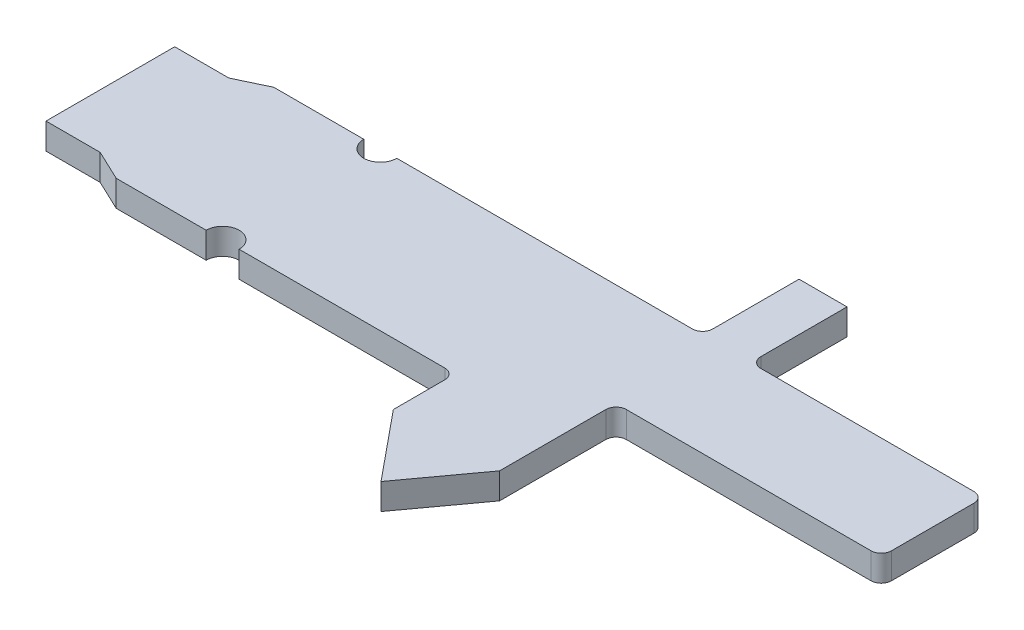
ISO-10303-21;
HEADER;
FILE_DESCRIPTION(('STEP AP214'),'2;1');
FILE_NAME('part.step','',(''),(''),'','','');
FILE_SCHEMA(('AUTOMOTIVE_DESIGN { 1 0 10303 214 1 1 1 1 }'));
ENDSEC;
DATA;
#1=APPLICATION_CONTEXT('core data for automotive mechanical design processes');
#2=APPLICATION_PROTOCOL_DEFINITION('international standard','automotive_design',2000,#1);
#3=PRODUCT_CONTEXT('',#1,'mechanical');
#4=PRODUCT('Part','Part','',(#3));
#5=PRODUCT_RELATED_PRODUCT_CATEGORY('part','',(#4));
#6=PRODUCT_DEFINITION_FORMATION('','',#4);
#7=PRODUCT_DEFINITION_CONTEXT('part definition',#1,'design');
#8=PRODUCT_DEFINITION('design','',#6,#7);
#9=PRODUCT_DEFINITION_SHAPE('','',#8);
#10=(LENGTH_UNIT() NAMED_UNIT(*) SI_UNIT(.MILLI.,.METRE.));
#11=(NAMED_UNIT(*) PLANE_ANGLE_UNIT() SI_UNIT($,.RADIAN.));
#12=(NAMED_UNIT(*) SI_UNIT($,.STERADIAN.) SOLID_ANGLE_UNIT());
#13=UNCERTAINTY_MEASURE_WITH_UNIT(LENGTH_MEASURE(1.E-05),#10,'distance_accuracy_value','');
#14=(GEOMETRIC_REPRESENTATION_CONTEXT(3) GLOBAL_UNCERTAINTY_ASSIGNED_CONTEXT((#13)) GLOBAL_UNIT_ASSIGNED_CONTEXT((#10,
#11,#12)) REPRESENTATION_CONTEXT('',''));
#15=CARTESIAN_POINT('',(0.,0.,0.));
#16=DIRECTION('',(0.,0.,1.));
#17=DIRECTION('',(1.,0.,0.));
#18=AXIS2_PLACEMENT_3D('',#15,#16,#17);
#19=CARTESIAN_POINT('',(-7.64733179537499,0.9652,2.921));
#20=DIRECTION('',(0.,-1.,0.));
#21=DIRECTION('',(0.,0.,-1.));
#22=AXIS2_PLACEMENT_3D('',#19,#20,#21);
#23=CYLINDRICAL_SURFACE('',#22,0.611531795374986);
#24=CARTESIAN_POINT('',(-7.64733179537499,0.,2.921));
#25=DIRECTION('',(0.,1.,0.));
#26=DIRECTION('',(0.,0.,1.));
#27=AXIS2_PLACEMENT_3D('',#24,#25,#26);
#28=CIRCLE('',#27,0.611531795374986);
#29=CARTESIAN_POINT('',(-7.0358,0.,2.921));
#30=VERTEX_POINT('',#29);
#31=CARTESIAN_POINT('',(-8.25886359074998,0.,2.921));
#32=VERTEX_POINT('',#31);
#33=EDGE_CURVE('E241',#30,#32,#28,.T.);
#34=ORIENTED_EDGE('',*,*,#33,.F.);
#35=DIRECTION('',(0.,-1.,0.));
#36=VECTOR('',#35,1.);
#37=CARTESIAN_POINT('',(-7.0358,0.9652,2.921));
#38=LINE('',#37,#36);
#39=CARTESIAN_POINT('',(-7.0358,0.9652,2.921));
#40=VERTEX_POINT('',#39);
#41=EDGE_CURVE('E11',#40,#30,#38,.T.);
#42=ORIENTED_EDGE('',*,*,#41,.F.);
#43=CARTESIAN_POINT('',(-7.64733179537499,0.9652,2.921));
#44=DIRECTION('',(0.,1.,0.));
#45=DIRECTION('',(0.,0.,1.));
#46=AXIS2_PLACEMENT_3D('',#43,#44,#45);
#47=CIRCLE('',#46,0.611531795374986);
#48=CARTESIAN_POINT('',(-8.25886359074998,0.9652,2.921));
#49=VERTEX_POINT('',#48);
#50=EDGE_CURVE('E312',#40,#49,#47,.T.);
#51=ORIENTED_EDGE('',*,*,#50,.T.);
#52=DIRECTION('',(0.,-1.,0.));
#53=VECTOR('',#52,1.);
#54=CARTESIAN_POINT('',(-8.25886359074998,0.9652,2.921));
#55=LINE('',#54,#53);
#56=EDGE_CURVE('E51',#49,#32,#55,.T.);
#57=ORIENTED_EDGE('',*,*,#56,.T.);
#58=EDGE_LOOP('',(#34,#42,#51,#57));
#59=FACE_BOUND('',#58,.T.);
#60=ADVANCED_FACE('F35',(#59),#23,.F.);
#61=CARTESIAN_POINT('',(0.,0.9652,2.921));
#62=DIRECTION('',(0.,0.,1.));
#63=DIRECTION('',(1.,0.,0.));
#64=AXIS2_PLACEMENT_3D('',#61,#62,#63);
#65=PLANE('',#64);
#66=DIRECTION('',(-1.,0.,0.));
#67=VECTOR('',#66,1.);
#68=CARTESIAN_POINT('',(0.,0.,2.921));
#69=LINE('',#68,#67);
#70=CARTESIAN_POINT('',(0.584199999999997,0.,2.921));
#71=VERTEX_POINT('',#70);
#72=EDGE_CURVE('E243',#71,#30,#69,.T.);
#73=ORIENTED_EDGE('',*,*,#72,.F.);
#74=DIRECTION('',(0.,-1.,0.));
#75=VECTOR('',#74,1.);
#76=CARTESIAN_POINT('',(0.584199999999997,0.9652,2.921));
#77=LINE('',#76,#75);
#78=CARTESIAN_POINT('',(0.584199999999997,0.9652,2.921));
#79=VERTEX_POINT('',#78);
#80=EDGE_CURVE('E43',#79,#71,#77,.T.);
#81=ORIENTED_EDGE('',*,*,#80,.F.);
#82=DIRECTION('',(-1.,0.,0.));
#83=VECTOR('',#82,1.);
#84=CARTESIAN_POINT('',(0.,0.9652,2.921));
#85=LINE('',#84,#83);
#86=EDGE_CURVE('E378',#79,#40,#85,.T.);
#87=ORIENTED_EDGE('',*,*,#86,.T.);
#88=ORIENTED_EDGE('',*,*,#41,.T.);
#89=EDGE_LOOP('',(#73,#81,#87,#88));
#90=FACE_BOUND('',#89,.T.);
#91=ADVANCED_FACE('F377',(#90),#65,.T.);
#92=CARTESIAN_POINT('',(0.5842,0.9652,3.302));
#93=DIRECTION('',(0.,-1.,0.));
#94=DIRECTION('',(0.,0.,-1.));
#95=AXIS2_PLACEMENT_3D('',#92,#93,#94);
#96=CYLINDRICAL_SURFACE('',#95,0.381);
#97=CARTESIAN_POINT('',(0.5842,0.,3.302));
#98=DIRECTION('',(0.,1.,0.));
#99=DIRECTION('',(0.,0.,1.));
#100=AXIS2_PLACEMENT_3D('',#97,#98,#99);
#101=CIRCLE('',#100,0.381);
#102=CARTESIAN_POINT('',(0.9652,0.,3.302));
#103=VERTEX_POINT('',#102);
#104=EDGE_CURVE('E246',#71,#103,#101,.F.);
#105=ORIENTED_EDGE('',*,*,#104,.T.);
#106=DIRECTION('',(0.,-1.,0.));
#107=VECTOR('',#106,1.);
#108=CARTESIAN_POINT('',(0.9652,0.9652,3.302));
#109=LINE('',#108,#107);
#110=CARTESIAN_POINT('',(0.9652,0.9652,3.302));
#111=VERTEX_POINT('',#110);
#112=EDGE_CURVE('E361',#111,#103,#109,.T.);
#113=ORIENTED_EDGE('',*,*,#112,.F.);
#114=CARTESIAN_POINT('',(0.5842,0.9652,3.302));
#115=DIRECTION('',(0.,1.,0.));
#116=DIRECTION('',(0.,0.,1.));
#117=AXIS2_PLACEMENT_3D('',#114,#115,#116);
#118=CIRCLE('',#117,0.381);
#119=EDGE_CURVE('E368',#79,#111,#118,.F.);
#120=ORIENTED_EDGE('',*,*,#119,.F.);
#121=ORIENTED_EDGE('',*,*,#80,.T.);
#122=EDGE_LOOP('',(#105,#113,#120,#121));
#123=FACE_BOUND('',#122,.T.);
#124=ADVANCED_FACE('F366',(#123),#96,.F.);
#125=CARTESIAN_POINT('',(0.9652,0.9652,0.));
#126=DIRECTION('',(1.,0.,0.));
#127=DIRECTION('',(0.,0.,-1.));
#128=AXIS2_PLACEMENT_3D('',#125,#126,#127);
#129=PLANE('',#128);
#130=DIRECTION('',(0.,0.,1.));
#131=VECTOR('',#130,1.);
#132=CARTESIAN_POINT('',(0.9652,0.,0.));
#133=LINE('',#132,#131);
#134=CARTESIAN_POINT('',(0.9652,0.,5.207));
#135=VERTEX_POINT('',#134);
#136=EDGE_CURVE('E248',#103,#135,#133,.T.);
#137=ORIENTED_EDGE('',*,*,#136,.T.);
#138=DIRECTION('',(0.,-1.,0.));
#139=VECTOR('',#138,1.);
#140=CARTESIAN_POINT('',(0.9652,0.9652,5.207));
#141=LINE('',#140,#139);
#142=CARTESIAN_POINT('',(0.9652,0.9652,5.207));
#143=VERTEX_POINT('',#142);
#144=EDGE_CURVE('E358',#143,#135,#141,.T.);
#145=ORIENTED_EDGE('',*,*,#144,.F.);
#146=DIRECTION('',(0.,0.,1.));
#147=VECTOR('',#146,1.);
#148=CARTESIAN_POINT('',(0.9652,0.9652,0.));
#149=LINE('',#148,#147);
#150=EDGE_CURVE('E727',#111,#143,#149,.T.);
#151=ORIENTED_EDGE('',*,*,#150,.F.);
#152=ORIENTED_EDGE('',*,*,#112,.T.);
#153=EDGE_LOOP('',(#137,#145,#151,#152));
#154=FACE_BOUND('',#153,.T.);
#155=ADVANCED_FACE('F396',(#154),#129,.F.);
#156=CARTESIAN_POINT('',(-1.97592681176752,0.9652,1.62025998564937));
#157=DIRECTION('',(0.773267790496398,0.,-0.634079588207047));
#158=DIRECTION('',(-0.634079588207047,0.,-0.773267790496398));
#159=AXIS2_PLACEMENT_3D('',#156,#157,#158);
#160=PLANE('',#159);
#161=DIRECTION('',(0.634079588207047,0.,0.773267790496398));
#162=VECTOR('',#161,1.);
#163=CARTESIAN_POINT('',(-1.97592681176752,0.,1.62025998564937));
#164=LINE('',#163,#162);
#165=CARTESIAN_POINT('',(3.048,0.,7.747));
#166=VERTEX_POINT('',#165);
#167=EDGE_CURVE('E250',#135,#166,#164,.T.);
#168=ORIENTED_EDGE('',*,*,#167,.T.);
#169=DIRECTION('',(0.,-1.,0.));
#170=VECTOR('',#169,1.);
#171=CARTESIAN_POINT('',(3.048,0.9652,7.747));
#172=LINE('',#171,#170);
#173=CARTESIAN_POINT('',(3.048,0.9652,7.747));
#174=VERTEX_POINT('',#173);
#175=EDGE_CURVE('E356',#174,#166,#172,.T.);
#176=ORIENTED_EDGE('',*,*,#175,.F.);
#177=DIRECTION('',(0.634079588207047,0.,0.773267790496398));
#178=VECTOR('',#177,1.);
#179=CARTESIAN_POINT('',(-1.97592681176752,0.9652,1.62025998564937));
#180=LINE('',#179,#178);
#181=EDGE_CURVE('E725',#143,#174,#180,.T.);
#182=ORIENTED_EDGE('',*,*,#181,.F.);
#183=ORIENTED_EDGE('',*,*,#144,.T.);
#184=EDGE_LOOP('',(#168,#176,#182,#183));
#185=FACE_BOUND('',#184,.T.);
#186=ADVANCED_FACE('F401',(#185),#160,.F.);
#187=CARTESIAN_POINT('',(5.67767629982386,0.9652,4.14470369887142));
#188=DIRECTION('',(0.807686990835386,0.,0.589611503309831));
#189=DIRECTION('',(0.589611503309831,0.,-0.807686990835386));
#190=AXIS2_PLACEMENT_3D('',#187,#188,#189);
#191=PLANE('',#190);
#192=DIRECTION('',(-0.589611503309831,0.,0.807686990835386));
#193=VECTOR('',#192,1.);
#194=CARTESIAN_POINT('',(5.67767629982386,0.,4.14470369887142));
#195=LINE('',#194,#193);
#196=CARTESIAN_POINT('',(4.9022,0.,5.207));
#197=VERTEX_POINT('',#196);
#198=EDGE_CURVE('E253',#197,#166,#195,.T.);
#199=ORIENTED_EDGE('',*,*,#198,.F.);
#200=DIRECTION('',(0.,-1.,0.));
#201=VECTOR('',#200,1.);
#202=CARTESIAN_POINT('',(4.9022,0.9652,5.207));
#203=LINE('',#202,#201);
#204=CARTESIAN_POINT('',(4.9022,0.9652,5.207));
#205=VERTEX_POINT('',#204);
#206=EDGE_CURVE('E354',#205,#197,#203,.T.);
#207=ORIENTED_EDGE('',*,*,#206,.F.);
#208=DIRECTION('',(-0.589611503309831,0.,0.807686990835386));
#209=VECTOR('',#208,1.);
#210=CARTESIAN_POINT('',(5.67767629982386,0.9652,4.14470369887142));
#211=LINE('',#210,#209);
#212=EDGE_CURVE('E729',#205,#174,#211,.T.);
#213=ORIENTED_EDGE('',*,*,#212,.T.);
#214=ORIENTED_EDGE('',*,*,#175,.T.);
#215=EDGE_LOOP('',(#199,#207,#213,#214));
#216=FACE_BOUND('',#215,.T.);
#217=ADVANCED_FACE('F405',(#216),#191,.T.);
#218=CARTESIAN_POINT('',(4.9022,0.9652,0.));
#219=DIRECTION('',(1.,0.,0.));
#220=DIRECTION('',(0.,0.,-1.));
#221=AXIS2_PLACEMENT_3D('',#218,#219,#220);
#222=PLANE('',#221);
#223=DIRECTION('',(0.,0.,1.));
#224=VECTOR('',#223,1.);
#225=CARTESIAN_POINT('',(4.9022,0.,0.));
#226=LINE('',#225,#224);
#227=CARTESIAN_POINT('',(4.9022,0.,1.27));
#228=VERTEX_POINT('',#227);
#229=EDGE_CURVE('E256',#228,#197,#226,.T.);
#230=ORIENTED_EDGE('',*,*,#229,.F.);
#231=DIRECTION('',(0.,-1.,0.));
#232=VECTOR('',#231,1.);
#233=CARTESIAN_POINT('',(4.9022,0.9652,1.27));
#234=LINE('',#233,#232);
#235=CARTESIAN_POINT('',(4.9022,0.9652,1.27));
#236=VERTEX_POINT('',#235);
#237=EDGE_CURVE('E352',#236,#228,#234,.T.);
#238=ORIENTED_EDGE('',*,*,#237,.F.);
#239=DIRECTION('',(0.,0.,1.));
#240=VECTOR('',#239,1.);
#241=CARTESIAN_POINT('',(4.9022,0.9652,0.));
#242=LINE('',#241,#240);
#243=EDGE_CURVE('E719',#236,#205,#242,.T.);
#244=ORIENTED_EDGE('',*,*,#243,.T.);
#245=ORIENTED_EDGE('',*,*,#206,.T.);
#246=EDGE_LOOP('',(#230,#238,#244,#245));
#247=FACE_BOUND('',#246,.T.);
#248=ADVANCED_FACE('F409',(#247),#222,.T.);
#249=CARTESIAN_POINT('',(5.2832,0.9652,1.27));
#250=DIRECTION('',(0.,-1.,0.));
#251=DIRECTION('',(0.,0.,-1.));
#252=AXIS2_PLACEMENT_3D('',#249,#250,#251);
#253=CYLINDRICAL_SURFACE('',#252,0.381);
#254=CARTESIAN_POINT('',(5.2832,0.,1.27));
#255=DIRECTION('',(0.,1.,0.));
#256=DIRECTION('',(0.,0.,1.));
#257=AXIS2_PLACEMENT_3D('',#254,#255,#256);
#258=CIRCLE('',#257,0.381);
#259=CARTESIAN_POINT('',(5.2832,0.,0.889));
#260=VERTEX_POINT('',#259);
#261=EDGE_CURVE('E259',#228,#260,#258,.F.);
#262=ORIENTED_EDGE('',*,*,#261,.T.);
#263=DIRECTION('',(0.,-1.,0.));
#264=VECTOR('',#263,1.);
#265=CARTESIAN_POINT('',(5.2832,0.9652,0.889));
#266=LINE('',#265,#264);
#267=CARTESIAN_POINT('',(5.2832,0.9652,0.889));
#268=VERTEX_POINT('',#267);
#269=EDGE_CURVE('E350',#268,#260,#266,.T.);
#270=ORIENTED_EDGE('',*,*,#269,.F.);
#271=CARTESIAN_POINT('',(5.2832,0.9652,1.27));
#272=DIRECTION('',(0.,1.,0.));
#273=DIRECTION('',(0.,0.,1.));
#274=AXIS2_PLACEMENT_3D('',#271,#272,#273);
#275=CIRCLE('',#274,0.381);
#276=EDGE_CURVE('E736',#236,#268,#275,.F.);
#277=ORIENTED_EDGE('',*,*,#276,.F.);
#278=ORIENTED_EDGE('',*,*,#237,.T.);
#279=EDGE_LOOP('',(#262,#270,#277,#278));
#280=FACE_BOUND('',#279,.T.);
#281=ADVANCED_FACE('F413',(#280),#253,.F.);
#282=CARTESIAN_POINT('',(0.,0.9652,0.889000000000001));
#283=DIRECTION('',(0.,0.,1.));
#284=DIRECTION('',(1.,0.,0.));
#285=AXIS2_PLACEMENT_3D('',#282,#283,#284);
#286=PLANE('',#285);
#287=DIRECTION('',(-1.,0.,0.));
#288=VECTOR('',#287,1.);
#289=CARTESIAN_POINT('',(0.,0.,0.889000000000001));
#290=LINE('',#289,#288);
#291=CARTESIAN_POINT('',(14.351,0.,0.888999999999999));
#292=VERTEX_POINT('',#291);
#293=EDGE_CURVE('E262',#292,#260,#290,.T.);
#294=ORIENTED_EDGE('',*,*,#293,.F.);
#295=DIRECTION('',(0.,-1.,0.));
#296=VECTOR('',#295,1.);
#297=CARTESIAN_POINT('',(14.351,0.9652,0.888999999999999));
#298=LINE('',#297,#296);
#299=CARTESIAN_POINT('',(14.351,0.9652,0.888999999999999));
#300=VERTEX_POINT('',#299);
#301=EDGE_CURVE('E348',#300,#292,#298,.T.);
#302=ORIENTED_EDGE('',*,*,#301,.F.);
#303=DIRECTION('',(-1.,0.,0.));
#304=VECTOR('',#303,1.);
#305=CARTESIAN_POINT('',(0.,0.9652,0.889000000000001));
#306=LINE('',#305,#304);
#307=EDGE_CURVE('E713',#300,#268,#306,.T.);
#308=ORIENTED_EDGE('',*,*,#307,.T.);
#309=ORIENTED_EDGE('',*,*,#269,.T.);
#310=EDGE_LOOP('',(#294,#302,#308,#309));
#311=FACE_BOUND('',#310,.T.);
#312=ADVANCED_FACE('F417',(#311),#286,.T.);
#313=CARTESIAN_POINT('',(14.351,0.9652,0.507999999999999));
#314=DIRECTION('',(0.,-1.,0.));
#315=DIRECTION('',(0.,0.,-1.));
#316=AXIS2_PLACEMENT_3D('',#313,#314,#315);
#317=CYLINDRICAL_SURFACE('',#316,0.381);
#318=CARTESIAN_POINT('',(14.351,0.,0.507999999999999));
#319=DIRECTION('',(0.,1.,0.));
#320=DIRECTION('',(0.,0.,1.));
#321=AXIS2_PLACEMENT_3D('',#318,#319,#320);
#322=CIRCLE('',#321,0.381);
#323=CARTESIAN_POINT('',(14.732,0.,0.507999999999996));
#324=VERTEX_POINT('',#323);
#325=EDGE_CURVE('E265',#292,#324,#322,.T.);
#326=ORIENTED_EDGE('',*,*,#325,.T.);
#327=DIRECTION('',(0.,-1.,0.));
#328=VECTOR('',#327,1.);
#329=CARTESIAN_POINT('',(14.732,0.9652,0.507999999999996));
#330=LINE('',#329,#328);
#331=CARTESIAN_POINT('',(14.732,0.9652,0.507999999999996));
#332=VERTEX_POINT('',#331);
#333=EDGE_CURVE('E346',#332,#324,#330,.T.);
#334=ORIENTED_EDGE('',*,*,#333,.F.);
#335=CARTESIAN_POINT('',(14.351,0.9652,0.507999999999999));
#336=DIRECTION('',(0.,1.,0.));
#337=DIRECTION('',(0.,0.,1.));
#338=AXIS2_PLACEMENT_3D('',#335,#336,#337);
#339=CIRCLE('',#338,0.381);
#340=EDGE_CURVE('E739',#300,#332,#339,.T.);
#341=ORIENTED_EDGE('',*,*,#340,.F.);
#342=ORIENTED_EDGE('',*,*,#301,.T.);
#343=EDGE_LOOP('',(#326,#334,#341,#342));
#344=FACE_BOUND('',#343,.T.);
#345=ADVANCED_FACE('F421',(#344),#317,.T.);
#346=CARTESIAN_POINT('',(14.732,0.9652,0.));
#347=DIRECTION('',(1.,0.,0.));
#348=DIRECTION('',(0.,0.,-1.));
#349=AXIS2_PLACEMENT_3D('',#346,#347,#348);
#350=PLANE('',#349);
#351=DIRECTION('',(0.,0.,1.));
#352=VECTOR('',#351,1.);
#353=CARTESIAN_POINT('',(14.732,0.,0.));
#354=LINE('',#353,#352);
#355=CARTESIAN_POINT('',(14.732,0.,-2.54));
#356=VERTEX_POINT('',#355);
#357=EDGE_CURVE('E268',#356,#324,#354,.T.);
#358=ORIENTED_EDGE('',*,*,#357,.F.);
#359=DIRECTION('',(0.,-1.,0.));
#360=VECTOR('',#359,1.);
#361=CARTESIAN_POINT('',(14.732,0.9652,-2.54));
#362=LINE('',#361,#360);
#363=CARTESIAN_POINT('',(14.732,0.9652,-2.54));
#364=VERTEX_POINT('',#363);
#365=EDGE_CURVE('E344',#364,#356,#362,.T.);
#366=ORIENTED_EDGE('',*,*,#365,.F.);
#367=DIRECTION('',(0.,0.,1.));
#368=VECTOR('',#367,1.);
#369=CARTESIAN_POINT('',(14.732,0.9652,0.));
#370=LINE('',#369,#368);
#371=EDGE_CURVE('E706',#364,#332,#370,.T.);
#372=ORIENTED_EDGE('',*,*,#371,.T.);
#373=ORIENTED_EDGE('',*,*,#333,.T.);
#374=EDGE_LOOP('',(#358,#366,#372,#373));
#375=FACE_BOUND('',#374,.T.);
#376=ADVANCED_FACE('F425',(#375),#350,.T.);
#377=CARTESIAN_POINT('',(14.351,0.9652,-2.54));
#378=DIRECTION('',(0.,-1.,0.));
#379=DIRECTION('',(0.,0.,-1.));
#380=AXIS2_PLACEMENT_3D('',#377,#378,#379);
#381=CYLINDRICAL_SURFACE('',#380,0.381);
#382=CARTESIAN_POINT('',(14.351,0.,-2.54));
#383=DIRECTION('',(0.,1.,0.));
#384=DIRECTION('',(0.,0.,1.));
#385=AXIS2_PLACEMENT_3D('',#382,#383,#384);
#386=CIRCLE('',#385,0.381);
#387=CARTESIAN_POINT('',(14.351,0.,-2.921));
#388=VERTEX_POINT('',#387);
#389=EDGE_CURVE('E271',#356,#388,#386,.T.);
#390=ORIENTED_EDGE('',*,*,#389,.T.);
#391=DIRECTION('',(0.,-1.,0.));
#392=VECTOR('',#391,1.);
#393=CARTESIAN_POINT('',(14.351,0.9652,-2.921));
#394=LINE('',#393,#392);
#395=CARTESIAN_POINT('',(14.351,0.9652,-2.921));
#396=VERTEX_POINT('',#395);
#397=EDGE_CURVE('E342',#396,#388,#394,.T.);
#398=ORIENTED_EDGE('',*,*,#397,.F.);
#399=CARTESIAN_POINT('',(14.351,0.9652,-2.54));
#400=DIRECTION('',(0.,1.,0.));
#401=DIRECTION('',(0.,0.,1.));
#402=AXIS2_PLACEMENT_3D('',#399,#400,#401);
#403=CIRCLE('',#402,0.381);
#404=EDGE_CURVE('E742',#364,#396,#403,.T.);
#405=ORIENTED_EDGE('',*,*,#404,.F.);
#406=ORIENTED_EDGE('',*,*,#365,.T.);
#407=EDGE_LOOP('',(#390,#398,#405,#406));
#408=FACE_BOUND('',#407,.T.);
#409=ADVANCED_FACE('F429',(#408),#381,.T.);
#410=CARTESIAN_POINT('',(0.,0.9652,-2.921));
#411=DIRECTION('',(0.,0.,-1.));
#412=DIRECTION('',(-1.,0.,0.));
#413=AXIS2_PLACEMENT_3D('',#410,#411,#412);
#414=PLANE('',#413);
#415=DIRECTION('',(1.,0.,0.));
#416=VECTOR('',#415,1.);
#417=CARTESIAN_POINT('',(0.,0.,-2.921));
#418=LINE('',#417,#416);
#419=CARTESIAN_POINT('',(6.45853237586421,0.,-2.921));
#420=VERTEX_POINT('',#419);
#421=EDGE_CURVE('E274',#420,#388,#418,.T.);
#422=ORIENTED_EDGE('',*,*,#421,.F.);
#423=DIRECTION('',(0.,-1.,0.));
#424=VECTOR('',#423,1.);
#425=CARTESIAN_POINT('',(6.45853237586421,0.9652,-2.921));
#426=LINE('',#425,#424);
#427=CARTESIAN_POINT('',(6.45853237586421,0.9652,-2.921));
#428=VERTEX_POINT('',#427);
#429=EDGE_CURVE('E340',#428,#420,#426,.T.);
#430=ORIENTED_EDGE('',*,*,#429,.F.);
#431=DIRECTION('',(1.,0.,0.));
#432=VECTOR('',#431,1.);
#433=CARTESIAN_POINT('',(0.,0.9652,-2.921));
#434=LINE('',#433,#432);
#435=EDGE_CURVE('E744',#428,#396,#434,.T.);
#436=ORIENTED_EDGE('',*,*,#435,.T.);
#437=ORIENTED_EDGE('',*,*,#397,.T.);
#438=EDGE_LOOP('',(#422,#430,#436,#437));
#439=FACE_BOUND('',#438,.T.);
#440=ADVANCED_FACE('F433',(#439),#414,.T.);
#441=CARTESIAN_POINT('',(6.45853237586421,0.9652,-3.302));
#442=DIRECTION('',(0.,-1.,0.));
#443=DIRECTION('',(0.,0.,-1.));
#444=AXIS2_PLACEMENT_3D('',#441,#442,#443);
#445=CYLINDRICAL_SURFACE('',#444,0.381);
#446=CARTESIAN_POINT('',(6.45853237586421,0.,-3.302));
#447=DIRECTION('',(0.,1.,0.));
#448=DIRECTION('',(0.,0.,1.));
#449=AXIS2_PLACEMENT_3D('',#446,#447,#448);
#450=CIRCLE('',#449,0.381);
#451=CARTESIAN_POINT('',(6.07753237586421,0.,-3.302));
#452=VERTEX_POINT('',#451);
#453=EDGE_CURVE('E277',#452,#420,#450,.T.);
#454=ORIENTED_EDGE('',*,*,#453,.F.);
#455=DIRECTION('',(0.,-1.,0.));
#456=VECTOR('',#455,1.);
#457=CARTESIAN_POINT('',(6.07753237586421,0.9652,-3.302));
#458=LINE('',#457,#456);
#459=CARTESIAN_POINT('',(6.07753237586421,0.9652,-3.302));
#460=VERTEX_POINT('',#459);
#461=EDGE_CURVE('E338',#460,#452,#458,.T.);
#462=ORIENTED_EDGE('',*,*,#461,.F.);
#463=CARTESIAN_POINT('',(6.45853237586421,0.9652,-3.302));
#464=DIRECTION('',(0.,1.,0.));
#465=DIRECTION('',(0.,0.,1.));
#466=AXIS2_PLACEMENT_3D('',#463,#464,#465);
#467=CIRCLE('',#466,0.381);
#468=EDGE_CURVE('E695',#460,#428,#467,.T.);
#469=ORIENTED_EDGE('',*,*,#468,.T.);
#470=ORIENTED_EDGE('',*,*,#429,.T.);
#471=EDGE_LOOP('',(#454,#462,#469,#470));
#472=FACE_BOUND('',#471,.T.);
#473=ADVANCED_FACE('F437',(#472),#445,.F.);
#474=CARTESIAN_POINT('',(6.07753237586421,0.9652,0.));
#475=DIRECTION('',(-1.,0.,0.));
#476=DIRECTION('',(0.,0.,1.));
#477=AXIS2_PLACEMENT_3D('',#474,#475,#476);
#478=PLANE('',#477);
#479=DIRECTION('',(0.,0.,-1.));
#480=VECTOR('',#479,1.);
#481=CARTESIAN_POINT('',(6.07753237586421,0.,0.));
#482=LINE('',#481,#480);
#483=CARTESIAN_POINT('',(6.07753237586421,0.,-6.49570717943372));
#484=VERTEX_POINT('',#483);
#485=EDGE_CURVE('E280',#452,#484,#482,.T.);
#486=ORIENTED_EDGE('',*,*,#485,.T.);
#487=DIRECTION('',(0.,-1.,0.));
#488=VECTOR('',#487,1.);
#489=CARTESIAN_POINT('',(6.07753237586421,0.9652,-6.49570717943372));
#490=LINE('',#489,#488);
#491=CARTESIAN_POINT('',(6.07753237586421,0.9652,-6.49570717943372));
#492=VERTEX_POINT('',#491);
#493=EDGE_CURVE('E336',#492,#484,#490,.T.);
#494=ORIENTED_EDGE('',*,*,#493,.F.);
#495=DIRECTION('',(0.,0.,-1.));
#496=VECTOR('',#495,1.);
#497=CARTESIAN_POINT('',(6.07753237586421,0.9652,0.));
#498=LINE('',#497,#496);
#499=EDGE_CURVE('E747',#460,#492,#498,.T.);
#500=ORIENTED_EDGE('',*,*,#499,.F.);
#501=ORIENTED_EDGE('',*,*,#461,.T.);
#502=EDGE_LOOP('',(#486,#494,#500,#501));
#503=FACE_BOUND('',#502,.T.);
#504=ADVANCED_FACE('F441',(#503),#478,.F.);
#505=CARTESIAN_POINT('',(0.,0.9652,-6.49570717943372));
#506=DIRECTION('',(0.,0.,-1.));
#507=DIRECTION('',(-1.,0.,0.));
#508=AXIS2_PLACEMENT_3D('',#505,#506,#507);
#509=PLANE('',#508);
#510=DIRECTION('',(1.,0.,0.));
#511=VECTOR('',#510,1.);
#512=CARTESIAN_POINT('',(0.,0.,-6.49570717943372));
#513=LINE('',#512,#511);
#514=CARTESIAN_POINT('',(4.29953237586421,0.,-6.49570717943372));
#515=VERTEX_POINT('',#514);
#516=EDGE_CURVE('E283',#515,#484,#513,.T.);
#517=ORIENTED_EDGE('',*,*,#516,.F.);
#518=DIRECTION('',(0.,-1.,0.));
#519=VECTOR('',#518,1.);
#520=CARTESIAN_POINT('',(4.29953237586421,0.9652,-6.49570717943372));
#521=LINE('',#520,#519);
#522=CARTESIAN_POINT('',(4.29953237586421,0.9652,-6.49570717943372));
#523=VERTEX_POINT('',#522);
#524=EDGE_CURVE('E334',#523,#515,#521,.T.);
#525=ORIENTED_EDGE('',*,*,#524,.F.);
#526=DIRECTION('',(1.,0.,0.));
#527=VECTOR('',#526,1.);
#528=CARTESIAN_POINT('',(0.,0.9652,-6.49570717943372));
#529=LINE('',#528,#527);
#530=EDGE_CURVE('E689',#523,#492,#529,.T.);
#531=ORIENTED_EDGE('',*,*,#530,.T.);
#532=ORIENTED_EDGE('',*,*,#493,.T.);
#533=EDGE_LOOP('',(#517,#525,#531,#532));
#534=FACE_BOUND('',#533,.T.);
#535=ADVANCED_FACE('F445',(#534),#509,.T.);
#536=CARTESIAN_POINT('',(4.29953237586421,0.9652,0.));
#537=DIRECTION('',(1.,0.,0.));
#538=DIRECTION('',(0.,0.,-1.));
#539=AXIS2_PLACEMENT_3D('',#536,#537,#538);
#540=PLANE('',#539);
#541=DIRECTION('',(0.,0.,1.));
#542=VECTOR('',#541,1.);
#543=CARTESIAN_POINT('',(4.29953237586421,0.,0.));
#544=LINE('',#543,#542);
#545=CARTESIAN_POINT('',(4.29953237586421,0.,-3.302));
#546=VERTEX_POINT('',#545);
#547=EDGE_CURVE('E286',#515,#546,#544,.T.);
#548=ORIENTED_EDGE('',*,*,#547,.T.);
#549=DIRECTION('',(0.,-1.,0.));
#550=VECTOR('',#549,1.);
#551=CARTESIAN_POINT('',(4.29953237586421,0.9652,-3.302));
#552=LINE('',#551,#550);
#553=CARTESIAN_POINT('',(4.29953237586421,0.9652,-3.302));
#554=VERTEX_POINT('',#553);
#555=EDGE_CURVE('E331',#554,#546,#552,.T.);
#556=ORIENTED_EDGE('',*,*,#555,.F.);
#557=DIRECTION('',(0.,0.,1.));
#558=VECTOR('',#557,1.);
#559=CARTESIAN_POINT('',(4.29953237586421,0.9652,0.));
#560=LINE('',#559,#558);
#561=EDGE_CURVE('E750',#523,#554,#560,.T.);
#562=ORIENTED_EDGE('',*,*,#561,.F.);
#563=ORIENTED_EDGE('',*,*,#524,.T.);
#564=EDGE_LOOP('',(#548,#556,#562,#563));
#565=FACE_BOUND('',#564,.T.);
#566=ADVANCED_FACE('F449',(#565),#540,.F.);
#567=CARTESIAN_POINT('',(3.91853237586421,0.9652,-3.302));
#568=DIRECTION('',(0.,-1.,0.));
#569=DIRECTION('',(0.,0.,-1.));
#570=AXIS2_PLACEMENT_3D('',#567,#568,#569);
#571=CYLINDRICAL_SURFACE('',#570,0.381);
#572=CARTESIAN_POINT('',(3.91853237586421,0.,-3.302));
#573=DIRECTION('',(0.,1.,0.));
#574=DIRECTION('',(0.,0.,1.));
#575=AXIS2_PLACEMENT_3D('',#572,#573,#574);
#576=CIRCLE('',#575,0.381);
#577=CARTESIAN_POINT('',(3.91853237586421,0.,-2.921));
#578=VERTEX_POINT('',#577);
#579=EDGE_CURVE('E288',#546,#578,#576,.F.);
#580=ORIENTED_EDGE('',*,*,#579,.T.);
#581=DIRECTION('',(0.,-1.,0.));
#582=VECTOR('',#581,1.);
#583=CARTESIAN_POINT('',(3.91853237586421,0.9652,-2.921));
#584=LINE('',#583,#582);
#585=CARTESIAN_POINT('',(3.91853237586421,0.9652,-2.921));
#586=VERTEX_POINT('',#585);
#587=EDGE_CURVE('E329',#586,#578,#584,.T.);
#588=ORIENTED_EDGE('',*,*,#587,.F.);
#589=CARTESIAN_POINT('',(3.91853237586421,0.9652,-3.302));
#590=DIRECTION('',(0.,1.,0.));
#591=DIRECTION('',(0.,0.,1.));
#592=AXIS2_PLACEMENT_3D('',#589,#590,#591);
#593=CIRCLE('',#592,0.381);
#594=EDGE_CURVE('E752',#554,#586,#593,.F.);
#595=ORIENTED_EDGE('',*,*,#594,.F.);
#596=ORIENTED_EDGE('',*,*,#555,.T.);
#597=EDGE_LOOP('',(#580,#588,#595,#596));
#598=FACE_BOUND('',#597,.T.);
#599=ADVANCED_FACE('F453',(#598),#571,.F.);
#600=CARTESIAN_POINT('',(0.,0.9652,-2.921));
#601=DIRECTION('',(0.,0.,-1.));
#602=DIRECTION('',(-1.,0.,0.));
#603=AXIS2_PLACEMENT_3D('',#600,#601,#602);
#604=PLANE('',#603);
#605=DIRECTION('',(1.,0.,0.));
#606=VECTOR('',#605,1.);
#607=CARTESIAN_POINT('',(0.,0.,-2.921));
#608=LINE('',#607,#606);
#609=CARTESIAN_POINT('',(-7.0358,0.,-2.921));
#610=VERTEX_POINT('',#609);
#611=EDGE_CURVE('E291',#610,#578,#608,.T.);
#612=ORIENTED_EDGE('',*,*,#611,.F.);
#613=DIRECTION('',(0.,-1.,0.));
#614=VECTOR('',#613,1.);
#615=CARTESIAN_POINT('',(-7.0358,0.9652,-2.921));
#616=LINE('',#615,#614);
#617=CARTESIAN_POINT('',(-7.0358,0.9652,-2.921));
#618=VERTEX_POINT('',#617);
#619=EDGE_CURVE('E327',#618,#610,#616,.T.);
#620=ORIENTED_EDGE('',*,*,#619,.F.);
#621=DIRECTION('',(1.,0.,0.));
#622=VECTOR('',#621,1.);
#623=CARTESIAN_POINT('',(0.,0.9652,-2.921));
#624=LINE('',#623,#622);
#625=EDGE_CURVE('E679',#618,#586,#624,.T.);
#626=ORIENTED_EDGE('',*,*,#625,.T.);
#627=ORIENTED_EDGE('',*,*,#587,.T.);
#628=EDGE_LOOP('',(#612,#620,#626,#627));
#629=FACE_BOUND('',#628,.T.);
#630=ADVANCED_FACE('F457',(#629),#604,.T.);
#631=CARTESIAN_POINT('',(-7.64733179537499,0.9652,-2.921));
#632=DIRECTION('',(0.,-1.,0.));
#633=DIRECTION('',(0.,0.,-1.));
#634=AXIS2_PLACEMENT_3D('',#631,#632,#633);
#635=CYLINDRICAL_SURFACE('',#634,0.611531795374986);
#636=CARTESIAN_POINT('',(-7.64733179537499,0.,-2.921));
#637=DIRECTION('',(0.,1.,0.));
#638=DIRECTION('',(0.,0.,1.));
#639=AXIS2_PLACEMENT_3D('',#636,#637,#638);
#640=CIRCLE('',#639,0.611531795374986);
#641=CARTESIAN_POINT('',(-8.25886359074998,0.,-2.921));
#642=VERTEX_POINT('',#641);
#643=EDGE_CURVE('E294',#610,#642,#640,.F.);
#644=ORIENTED_EDGE('',*,*,#643,.T.);
#645=DIRECTION('',(0.,-1.,0.));
#646=VECTOR('',#645,1.);
#647=CARTESIAN_POINT('',(-8.25886359074998,0.9652,-2.921));
#648=LINE('',#647,#646);
#649=CARTESIAN_POINT('',(-8.25886359074998,0.9652,-2.921));
#650=VERTEX_POINT('',#649);
#651=EDGE_CURVE('E324',#650,#642,#648,.T.);
#652=ORIENTED_EDGE('',*,*,#651,.F.);
#653=CARTESIAN_POINT('',(-7.64733179537499,0.9652,-2.921));
#654=DIRECTION('',(0.,1.,0.));
#655=DIRECTION('',(0.,0.,1.));
#656=AXIS2_PLACEMENT_3D('',#653,#654,#655);
#657=CIRCLE('',#656,0.611531795374986);
#658=EDGE_CURVE('E755',#618,#650,#657,.F.);
#659=ORIENTED_EDGE('',*,*,#658,.F.);
#660=ORIENTED_EDGE('',*,*,#619,.T.);
#661=EDGE_LOOP('',(#644,#652,#659,#660));
#662=FACE_BOUND('',#661,.T.);
#663=ADVANCED_FACE('F461',(#662),#635,.F.);
#664=CARTESIAN_POINT('',(0.,0.9652,-2.921));
#665=DIRECTION('',(0.,0.,1.));
#666=DIRECTION('',(1.,0.,0.));
#667=AXIS2_PLACEMENT_3D('',#664,#665,#666);
#668=PLANE('',#667);
#669=DIRECTION('',(-1.,0.,0.));
#670=VECTOR('',#669,1.);
#671=CARTESIAN_POINT('',(0.,0.,-2.921));
#672=LINE('',#671,#670);
#673=CARTESIAN_POINT('',(-11.5943109710059,0.,-2.921));
#674=VERTEX_POINT('',#673);
#675=EDGE_CURVE('E296',#642,#674,#672,.T.);
#676=ORIENTED_EDGE('',*,*,#675,.T.);
#677=DIRECTION('',(0.,-1.,0.));
#678=VECTOR('',#677,1.);
#679=CARTESIAN_POINT('',(-11.5943109710059,0.9652,-2.921));
#680=LINE('',#679,#678);
#681=CARTESIAN_POINT('',(-11.5943109710059,0.9652,-2.921));
#682=VERTEX_POINT('',#681);
#683=EDGE_CURVE('E321',#682,#674,#680,.T.);
#684=ORIENTED_EDGE('',*,*,#683,.F.);
#685=DIRECTION('',(-1.,0.,0.));
#686=VECTOR('',#685,1.);
#687=CARTESIAN_POINT('',(0.,0.9652,-2.921));
#688=LINE('',#687,#686);
#689=EDGE_CURVE('E670',#650,#682,#688,.T.);
#690=ORIENTED_EDGE('',*,*,#689,.F.);
#691=ORIENTED_EDGE('',*,*,#651,.T.);
#692=EDGE_LOOP('',(#676,#684,#690,#691));
#693=FACE_BOUND('',#692,.T.);
#694=ADVANCED_FACE('F465',(#693),#668,.F.);
#695=CARTESIAN_POINT('',(-3.26057255516811,0.9652,-6.87398492291527));
#696=DIRECTION('',(0.428566622880204,0.,0.903510182429095));
#697=DIRECTION('',(0.903510182429095,0.,-0.428566622880204));
#698=AXIS2_PLACEMENT_3D('',#695,#696,#697);
#699=PLANE('',#698);
#700=DIRECTION('',(-0.903510182429095,0.,0.428566622880204));
#701=VECTOR('',#700,1.);
#702=CARTESIAN_POINT('',(-3.26057255516811,0.,-6.87398492291527));
#703=LINE('',#702,#701);
#704=CARTESIAN_POINT('',(-12.7236172070937,0.,-2.38533037589405));
#705=VERTEX_POINT('',#704);
#706=EDGE_CURVE('E298',#674,#705,#703,.T.);
#707=ORIENTED_EDGE('',*,*,#706,.T.);
#708=DIRECTION('',(0.,-1.,0.));
#709=VECTOR('',#708,1.);
#710=CARTESIAN_POINT('',(-12.7236172070937,0.9652,-2.38533037589405));
#711=LINE('',#710,#709);
#712=CARTESIAN_POINT('',(-12.7236172070937,0.9652,-2.38533037589405));
#713=VERTEX_POINT('',#712);
#714=EDGE_CURVE('E318',#713,#705,#711,.T.);
#715=ORIENTED_EDGE('',*,*,#714,.F.);
#716=DIRECTION('',(-0.903510182429095,0.,0.428566622880204));
#717=VECTOR('',#716,1.);
#718=CARTESIAN_POINT('',(-3.26057255516811,0.9652,-6.87398492291527));
#719=LINE('',#718,#717);
#720=EDGE_CURVE('E667',#682,#713,#719,.T.);
#721=ORIENTED_EDGE('',*,*,#720,.F.);
#722=ORIENTED_EDGE('',*,*,#683,.T.);
#723=EDGE_LOOP('',(#707,#715,#721,#722));
#724=FACE_BOUND('',#723,.T.);
#725=ADVANCED_FACE('F469',(#724),#699,.F.);
#726=CARTESIAN_POINT('',(0.,0.9652,-2.38533037589405));
#727=DIRECTION('',(0.,0.,1.));
#728=DIRECTION('',(1.,0.,0.));
#729=AXIS2_PLACEMENT_3D('',#726,#727,#728);
#730=PLANE('',#729);
#731=DIRECTION('',(-1.,0.,0.));
#732=VECTOR('',#731,1.);
#733=CARTESIAN_POINT('',(0.,0.,-2.38533037589405));
#734=LINE('',#733,#732);
#735=CARTESIAN_POINT('',(-14.732,0.,-2.38533037589405));
#736=VERTEX_POINT('',#735);
#737=EDGE_CURVE('E300',#705,#736,#734,.T.);
#738=ORIENTED_EDGE('',*,*,#737,.T.);
#739=DIRECTION('',(0.,-1.,0.));
#740=VECTOR('',#739,1.);
#741=CARTESIAN_POINT('',(-14.732,0.9652,-2.38533037589405));
#742=LINE('',#741,#740);
#743=CARTESIAN_POINT('',(-14.732,0.9652,-2.38533037589405));
#744=VERTEX_POINT('',#743);
#745=EDGE_CURVE('E316',#744,#736,#742,.T.);
#746=ORIENTED_EDGE('',*,*,#745,.F.);
#747=DIRECTION('',(-1.,0.,0.));
#748=VECTOR('',#747,1.);
#749=CARTESIAN_POINT('',(0.,0.9652,-2.38533037589405));
#750=LINE('',#749,#748);
#751=EDGE_CURVE('E665',#713,#744,#750,.T.);
#752=ORIENTED_EDGE('',*,*,#751,.F.);
#753=ORIENTED_EDGE('',*,*,#714,.T.);
#754=EDGE_LOOP('',(#738,#746,#752,#753));
#755=FACE_BOUND('',#754,.T.);
#756=ADVANCED_FACE('F473',(#755),#730,.F.);
#757=CARTESIAN_POINT('',(-14.732,0.9652,0.));
#758=DIRECTION('',(-1.,0.,0.));
#759=DIRECTION('',(0.,0.,1.));
#760=AXIS2_PLACEMENT_3D('',#757,#758,#759);
#761=PLANE('',#760);
#762=DIRECTION('',(0.,0.,-1.));
#763=VECTOR('',#762,1.);
#764=CARTESIAN_POINT('',(-14.732,0.,0.));
#765=LINE('',#764,#763);
#766=CARTESIAN_POINT('',(-14.732,0.,2.38533037589406));
#767=VERTEX_POINT('',#766);
#768=EDGE_CURVE('E303',#767,#736,#765,.T.);
#769=ORIENTED_EDGE('',*,*,#768,.F.);
#770=DIRECTION('',(0.,-1.,0.));
#771=VECTOR('',#770,1.);
#772=CARTESIAN_POINT('',(-14.732,0.9652,2.38533037589406));
#773=LINE('',#772,#771);
#774=CARTESIAN_POINT('',(-14.732,0.9652,2.38533037589406));
#775=VERTEX_POINT('',#774);
#776=EDGE_CURVE('E224',#775,#767,#773,.T.);
#777=ORIENTED_EDGE('',*,*,#776,.F.);
#778=DIRECTION('',(0.,0.,-1.));
#779=VECTOR('',#778,1.);
#780=CARTESIAN_POINT('',(-14.732,0.9652,0.));
#781=LINE('',#780,#779);
#782=EDGE_CURVE('E233',#775,#744,#781,.T.);
#783=ORIENTED_EDGE('',*,*,#782,.T.);
#784=ORIENTED_EDGE('',*,*,#745,.T.);
#785=EDGE_LOOP('',(#769,#777,#783,#784));
#786=FACE_BOUND('',#785,.T.);
#787=ADVANCED_FACE('F477',(#786),#761,.T.);
#788=CARTESIAN_POINT('',(0.,0.9652,2.38533037589406));
#789=DIRECTION('',(0.,0.,1.));
#790=DIRECTION('',(1.,0.,0.));
#791=AXIS2_PLACEMENT_3D('',#788,#789,#790);
#792=PLANE('',#791);
#793=DIRECTION('',(-1.,0.,0.));
#794=VECTOR('',#793,1.);
#795=CARTESIAN_POINT('',(0.,0.,2.38533037589406));
#796=LINE('',#795,#794);
#797=CARTESIAN_POINT('',(-12.7236172070937,0.,2.38533037589406));
#798=VERTEX_POINT('',#797);
#799=EDGE_CURVE('E220',#798,#767,#796,.T.);
#800=ORIENTED_EDGE('',*,*,#799,.F.);
#801=DIRECTION('',(0.,-1.,0.));
#802=VECTOR('',#801,1.);
#803=CARTESIAN_POINT('',(-12.7236172070937,0.9652,2.38533037589406));
#804=LINE('',#803,#802);
#805=CARTESIAN_POINT('',(-12.7236172070937,0.9652,2.38533037589406));
#806=VERTEX_POINT('',#805);
#807=EDGE_CURVE('E215',#806,#798,#804,.T.);
#808=ORIENTED_EDGE('',*,*,#807,.F.);
#809=DIRECTION('',(-1.,0.,0.));
#810=VECTOR('',#809,1.);
#811=CARTESIAN_POINT('',(0.,0.9652,2.38533037589406));
#812=LINE('',#811,#810);
#813=EDGE_CURVE('E218',#806,#775,#812,.T.);
#814=ORIENTED_EDGE('',*,*,#813,.T.);
#815=ORIENTED_EDGE('',*,*,#776,.T.);
#816=EDGE_LOOP('',(#800,#808,#814,#815));
#817=FACE_BOUND('',#816,.T.);
#818=ADVANCED_FACE('F217',(#817),#792,.T.);
#819=CARTESIAN_POINT('',(-3.2605725551681,0.9652,6.87398492291527));
#820=DIRECTION('',(-0.428566622880204,0.,0.903510182429096));
#821=DIRECTION('',(0.903510182429096,0.,0.428566622880204));
#822=AXIS2_PLACEMENT_3D('',#819,#820,#821);
#823=PLANE('',#822);
#824=DIRECTION('',(-0.903510182429096,0.,-0.428566622880204));
#825=VECTOR('',#824,1.);
#826=CARTESIAN_POINT('',(-3.2605725551681,0.,6.87398492291527));
#827=LINE('',#826,#825);
#828=CARTESIAN_POINT('',(-11.5943109710059,0.,2.921));
#829=VERTEX_POINT('',#828);
#830=EDGE_CURVE('E307',#829,#798,#827,.T.);
#831=ORIENTED_EDGE('',*,*,#830,.F.);
#832=DIRECTION('',(0.,-1.,0.));
#833=VECTOR('',#832,1.);
#834=CARTESIAN_POINT('',(-11.5943109710059,0.9652,2.921));
#835=LINE('',#834,#833);
#836=CARTESIAN_POINT('',(-11.5943109710059,0.9652,2.921));
#837=VERTEX_POINT('',#836);
#838=EDGE_CURVE('E133',#837,#829,#835,.T.);
#839=ORIENTED_EDGE('',*,*,#838,.F.);
#840=DIRECTION('',(-0.903510182429096,0.,-0.428566622880204));
#841=VECTOR('',#840,1.);
#842=CARTESIAN_POINT('',(-3.2605725551681,0.9652,6.87398492291527));
#843=LINE('',#842,#841);
#844=EDGE_CURVE('E231',#837,#806,#843,.T.);
#845=ORIENTED_EDGE('',*,*,#844,.T.);
#846=ORIENTED_EDGE('',*,*,#807,.T.);
#847=EDGE_LOOP('',(#831,#839,#845,#846));
#848=FACE_BOUND('',#847,.T.);
#849=ADVANCED_FACE('F235',(#848),#823,.T.);
#850=CARTESIAN_POINT('',(0.,0.9652,2.921));
#851=DIRECTION('',(0.,0.,1.));
#852=DIRECTION('',(1.,0.,0.));
#853=AXIS2_PLACEMENT_3D('',#850,#851,#852);
#854=PLANE('',#853);
#855=DIRECTION('',(-1.,0.,0.));
#856=VECTOR('',#855,1.);
#857=CARTESIAN_POINT('',(0.,0.,2.921));
#858=LINE('',#857,#856);
#859=EDGE_CURVE('E309',#32,#829,#858,.T.);
#860=ORIENTED_EDGE('',*,*,#859,.F.);
#861=ORIENTED_EDGE('',*,*,#56,.F.);
#862=DIRECTION('',(-1.,0.,0.));
#863=VECTOR('',#862,1.);
#864=CARTESIAN_POINT('',(0.,0.9652,2.921));
#865=LINE('',#864,#863);
#866=EDGE_CURVE('E236',#49,#837,#865,.T.);
#867=ORIENTED_EDGE('',*,*,#866,.T.);
#868=ORIENTED_EDGE('',*,*,#838,.T.);
#869=EDGE_LOOP('',(#860,#861,#867,#868));
#870=FACE_BOUND('',#869,.T.);
#871=ADVANCED_FACE('F379',(#870),#854,.T.);
#872=CARTESIAN_POINT('',(0.,0.9652,0.));
#873=DIRECTION('',(0.,1.,0.));
#874=DIRECTION('',(0.,0.,1.));
#875=AXIS2_PLACEMENT_3D('',#872,#873,#874);
#876=PLANE('',#875);
#877=ORIENTED_EDGE('',*,*,#50,.F.);
#878=ORIENTED_EDGE('',*,*,#86,.F.);
#879=ORIENTED_EDGE('',*,*,#119,.T.);
#880=ORIENTED_EDGE('',*,*,#150,.T.);
#881=ORIENTED_EDGE('',*,*,#181,.T.);
#882=ORIENTED_EDGE('',*,*,#212,.F.);
#883=ORIENTED_EDGE('',*,*,#243,.F.);
#884=ORIENTED_EDGE('',*,*,#276,.T.);
#885=ORIENTED_EDGE('',*,*,#307,.F.);
#886=ORIENTED_EDGE('',*,*,#340,.T.);
#887=ORIENTED_EDGE('',*,*,#371,.F.);
#888=ORIENTED_EDGE('',*,*,#404,.T.);
#889=ORIENTED_EDGE('',*,*,#435,.F.);
#890=ORIENTED_EDGE('',*,*,#468,.F.);
#891=ORIENTED_EDGE('',*,*,#499,.T.);
#892=ORIENTED_EDGE('',*,*,#530,.F.);
#893=ORIENTED_EDGE('',*,*,#561,.T.);
#894=ORIENTED_EDGE('',*,*,#594,.T.);
#895=ORIENTED_EDGE('',*,*,#625,.F.);
#896=ORIENTED_EDGE('',*,*,#658,.T.);
#897=ORIENTED_EDGE('',*,*,#689,.T.);
#898=ORIENTED_EDGE('',*,*,#720,.T.);
#899=ORIENTED_EDGE('',*,*,#751,.T.);
#900=ORIENTED_EDGE('',*,*,#782,.F.);
#901=ORIENTED_EDGE('',*,*,#813,.F.);
#902=ORIENTED_EDGE('',*,*,#844,.F.);
#903=ORIENTED_EDGE('',*,*,#866,.F.);
#904=EDGE_LOOP('',(#877,#878,#879,#880,#881,#882,#883,#884,#885,#886,#887,#888,#889,#890,#891,
#892,#893,#894,#895,#896,#897,#898,#899,#900,#901,#902,#903));
#905=FACE_BOUND('',#904,.T.);
#906=ADVANCED_FACE('F229',(#905),#876,.T.);
#907=CARTESIAN_POINT('',(0.,0.,0.));
#908=DIRECTION('',(0.,1.,0.));
#909=DIRECTION('',(0.,0.,1.));
#910=AXIS2_PLACEMENT_3D('',#907,#908,#909);
#911=PLANE('',#910);
#912=ORIENTED_EDGE('',*,*,#33,.T.);
#913=ORIENTED_EDGE('',*,*,#859,.T.);
#914=ORIENTED_EDGE('',*,*,#830,.T.);
#915=ORIENTED_EDGE('',*,*,#799,.T.);
#916=ORIENTED_EDGE('',*,*,#768,.T.);
#917=ORIENTED_EDGE('',*,*,#737,.F.);
#918=ORIENTED_EDGE('',*,*,#706,.F.);
#919=ORIENTED_EDGE('',*,*,#675,.F.);
#920=ORIENTED_EDGE('',*,*,#643,.F.);
#921=ORIENTED_EDGE('',*,*,#611,.T.);
#922=ORIENTED_EDGE('',*,*,#579,.F.);
#923=ORIENTED_EDGE('',*,*,#547,.F.);
#924=ORIENTED_EDGE('',*,*,#516,.T.);
#925=ORIENTED_EDGE('',*,*,#485,.F.);
#926=ORIENTED_EDGE('',*,*,#453,.T.);
#927=ORIENTED_EDGE('',*,*,#421,.T.);
#928=ORIENTED_EDGE('',*,*,#389,.F.);
#929=ORIENTED_EDGE('',*,*,#357,.T.);
#930=ORIENTED_EDGE('',*,*,#325,.F.);
#931=ORIENTED_EDGE('',*,*,#293,.T.);
#932=ORIENTED_EDGE('',*,*,#261,.F.);
#933=ORIENTED_EDGE('',*,*,#229,.T.);
#934=ORIENTED_EDGE('',*,*,#198,.T.);
#935=ORIENTED_EDGE('',*,*,#167,.F.);
#936=ORIENTED_EDGE('',*,*,#136,.F.);
#937=ORIENTED_EDGE('',*,*,#104,.F.);
#938=ORIENTED_EDGE('',*,*,#72,.T.);
#939=EDGE_LOOP('',(#912,#913,#914,#915,#916,#917,#918,#919,#920,#921,#922,#923,#924,#925,#926,
#927,#928,#929,#930,#931,#932,#933,#934,#935,#936,#937,#938));
#940=FACE_BOUND('',#939,.T.);
#941=ADVANCED_FACE('F375',(#940),#911,.F.);
#942=CLOSED_SHELL('',(#60,#91,#124,#155,#186,#217,#248,#281,#312,#345,#376,#409,#440,#473,#504,
#535,#566,#599,#630,#663,#694,#725,#756,#787,#818,#849,#871,#906,#941));
#943=MANIFOLD_SOLID_BREP('B2',#942);
#944=ADVANCED_BREP_SHAPE_REPRESENTATION('',(#18,#943),#14);
#945=SHAPE_DEFINITION_REPRESENTATION(#9,#944);
ENDSEC;
END-ISO-10303-21;
